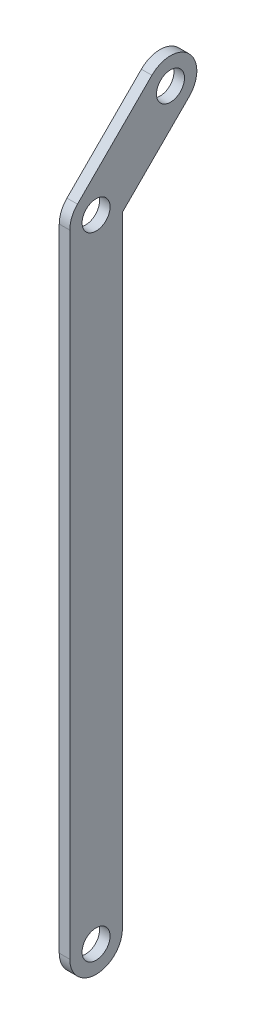
ISO-10303-21;
HEADER;
FILE_DESCRIPTION(('STEP AP214'),'2;1');
FILE_NAME('part.step','',(''),(''),'','','');
FILE_SCHEMA(('AUTOMOTIVE_DESIGN { 1 0 10303 214 1 1 1 1 }'));
ENDSEC;
DATA;
#1=APPLICATION_CONTEXT('core data for automotive mechanical design processes');
#2=APPLICATION_PROTOCOL_DEFINITION('international standard','automotive_design',2000,#1);
#3=PRODUCT_CONTEXT('',#1,'mechanical');
#4=PRODUCT('Part','Part','',(#3));
#5=PRODUCT_RELATED_PRODUCT_CATEGORY('part','',(#4));
#6=PRODUCT_DEFINITION_FORMATION('','',#4);
#7=PRODUCT_DEFINITION_CONTEXT('part definition',#1,'design');
#8=PRODUCT_DEFINITION('design','',#6,#7);
#9=PRODUCT_DEFINITION_SHAPE('','',#8);
#10=(LENGTH_UNIT() NAMED_UNIT(*) SI_UNIT(.MILLI.,.METRE.));
#11=(NAMED_UNIT(*) PLANE_ANGLE_UNIT() SI_UNIT($,.RADIAN.));
#12=(NAMED_UNIT(*) SI_UNIT($,.STERADIAN.) SOLID_ANGLE_UNIT());
#13=UNCERTAINTY_MEASURE_WITH_UNIT(LENGTH_MEASURE(1.E-05),#10,'distance_accuracy_value','');
#14=(GEOMETRIC_REPRESENTATION_CONTEXT(3) GLOBAL_UNCERTAINTY_ASSIGNED_CONTEXT((#13)) GLOBAL_UNIT_ASSIGNED_CONTEXT((#10,
#11,#12)) REPRESENTATION_CONTEXT('',''));
#15=CARTESIAN_POINT('',(0.,0.,0.));
#16=DIRECTION('',(0.,0.,1.));
#17=DIRECTION('',(1.,0.,0.));
#18=AXIS2_PLACEMENT_3D('',#15,#16,#17);
#19=CARTESIAN_POINT('',(2.54,-152.4,0.));
#20=DIRECTION('',(-1.,0.,0.));
#21=DIRECTION('',(0.,0.,1.));
#22=AXIS2_PLACEMENT_3D('',#19,#20,#21);
#23=CYLINDRICAL_SURFACE('',#22,6.35);
#24=CARTESIAN_POINT('',(0.,-152.4,0.));
#25=DIRECTION('',(1.,0.,0.));
#26=DIRECTION('',(0.,0.,-1.));
#27=AXIS2_PLACEMENT_3D('',#24,#25,#26);
#28=CIRCLE('',#27,6.35);
#29=CARTESIAN_POINT('',(0.,-152.4,6.34999999999998));
#30=VERTEX_POINT('',#29);
#31=CARTESIAN_POINT('',(0.,-152.4,-6.35000000000002));
#32=VERTEX_POINT('',#31);
#33=EDGE_CURVE('E124',#30,#32,#28,.T.);
#34=ORIENTED_EDGE('',*,*,#33,.T.);
#35=DIRECTION('',(-1.,0.,0.));
#36=VECTOR('',#35,1.);
#37=CARTESIAN_POINT('',(2.54,-152.4,-6.35000000000002));
#38=LINE('',#37,#36);
#39=CARTESIAN_POINT('',(2.54,-152.4,-6.35000000000002));
#40=VERTEX_POINT('',#39);
#41=EDGE_CURVE('E11',#40,#32,#38,.T.);
#42=ORIENTED_EDGE('',*,*,#41,.F.);
#43=CARTESIAN_POINT('',(2.54,-152.4,0.));
#44=DIRECTION('',(1.,0.,0.));
#45=DIRECTION('',(0.,0.,-1.));
#46=AXIS2_PLACEMENT_3D('',#43,#44,#45);
#47=CIRCLE('',#46,6.35);
#48=CARTESIAN_POINT('',(2.54,-152.4,6.34999999999998));
#49=VERTEX_POINT('',#48);
#50=EDGE_CURVE('E137',#49,#40,#47,.T.);
#51=ORIENTED_EDGE('',*,*,#50,.F.);
#52=DIRECTION('',(-1.,0.,0.));
#53=VECTOR('',#52,1.);
#54=CARTESIAN_POINT('',(2.54,-152.4,6.34999999999998));
#55=LINE('',#54,#53);
#56=EDGE_CURVE('E120',#49,#30,#55,.T.);
#57=ORIENTED_EDGE('',*,*,#56,.T.);
#58=EDGE_LOOP('',(#34,#42,#51,#57));
#59=FACE_BOUND('',#58,.T.);
#60=ADVANCED_FACE('F33',(#59),#23,.T.);
#61=CARTESIAN_POINT('',(2.54,-2.63025612106913,-6.35));
#62=DIRECTION('',(0.,0.,1.));
#63=DIRECTION('',(0.,-1.,0.));
#64=AXIS2_PLACEMENT_3D('',#61,#62,#63);
#65=PLANE('',#64);
#66=DIRECTION('',(0.,1.,0.));
#67=VECTOR('',#66,1.);
#68=CARTESIAN_POINT('',(0.,-2.63025612106913,-6.35));
#69=LINE('',#68,#67);
#70=CARTESIAN_POINT('',(0.,-2.63025612106913,-6.35));
#71=VERTEX_POINT('',#70);
#72=EDGE_CURVE('E127',#32,#71,#69,.T.);
#73=ORIENTED_EDGE('',*,*,#72,.T.);
#74=DIRECTION('',(-1.,0.,0.));
#75=VECTOR('',#74,1.);
#76=CARTESIAN_POINT('',(2.54,-2.63025612106913,-6.35));
#77=LINE('',#76,#75);
#78=CARTESIAN_POINT('',(2.54,-2.63025612106913,-6.35));
#79=VERTEX_POINT('',#78);
#80=EDGE_CURVE('E42',#79,#71,#77,.T.);
#81=ORIENTED_EDGE('',*,*,#80,.F.);
#82=DIRECTION('',(0.,1.,0.));
#83=VECTOR('',#82,1.);
#84=CARTESIAN_POINT('',(2.54,-2.63025612106913,-6.35));
#85=LINE('',#84,#83);
#86=EDGE_CURVE('E90',#40,#79,#85,.T.);
#87=ORIENTED_EDGE('',*,*,#86,.F.);
#88=ORIENTED_EDGE('',*,*,#41,.T.);
#89=EDGE_LOOP('',(#73,#81,#87,#88));
#90=FACE_BOUND('',#89,.T.);
#91=ADVANCED_FACE('F202',(#90),#65,.F.);
#92=CARTESIAN_POINT('',(2.54,-2.63025612106913,-6.35));
#93=DIRECTION('',(0.,0.707106781186543,0.707106781186552));
#94=DIRECTION('',(0.,-0.707106781186552,0.707106781186543));
#95=AXIS2_PLACEMENT_3D('',#92,#93,#94);
#96=PLANE('',#95);
#97=DIRECTION('',(0.,0.707106781186552,-0.707106781186543));
#98=VECTOR('',#97,1.);
#99=CARTESIAN_POINT('',(0.,-2.63025612106913,-6.35));
#100=LINE('',#99,#98);
#101=CARTESIAN_POINT('',(0.,13.4703841816039,-22.4506403026728));
#102=VERTEX_POINT('',#101);
#103=EDGE_CURVE('E130',#71,#102,#100,.T.);
#104=ORIENTED_EDGE('',*,*,#103,.T.);
#105=DIRECTION('',(-1.,0.,0.));
#106=VECTOR('',#105,1.);
#107=CARTESIAN_POINT('',(2.54,13.4703841816039,-22.4506403026728));
#108=LINE('',#107,#106);
#109=CARTESIAN_POINT('',(2.54,13.4703841816039,-22.4506403026728));
#110=VERTEX_POINT('',#109);
#111=EDGE_CURVE('E141',#110,#102,#108,.T.);
#112=ORIENTED_EDGE('',*,*,#111,.F.);
#113=DIRECTION('',(0.,0.707106781186552,-0.707106781186543));
#114=VECTOR('',#113,1.);
#115=CARTESIAN_POINT('',(2.54,-2.63025612106913,-6.35));
#116=LINE('',#115,#114);
#117=EDGE_CURVE('E150',#79,#110,#116,.T.);
#118=ORIENTED_EDGE('',*,*,#117,.F.);
#119=ORIENTED_EDGE('',*,*,#80,.T.);
#120=EDGE_LOOP('',(#104,#112,#118,#119));
#121=FACE_BOUND('',#120,.T.);
#122=ADVANCED_FACE('F148',(#121),#96,.F.);
#123=CARTESIAN_POINT('',(2.54,17.9605122421384,-17.9605122421382));
#124=DIRECTION('',(-1.,0.,0.));
#125=DIRECTION('',(0.,0.,1.));
#126=AXIS2_PLACEMENT_3D('',#123,#124,#125);
#127=CYLINDRICAL_SURFACE('',#126,6.35);
#128=CARTESIAN_POINT('',(0.,17.9605122421384,-17.9605122421382));
#129=DIRECTION('',(1.,0.,0.));
#130=DIRECTION('',(0.,0.,-1.));
#131=AXIS2_PLACEMENT_3D('',#128,#129,#130);
#132=CIRCLE('',#131,6.35);
#133=CARTESIAN_POINT('',(0.,22.450640302673,-13.4703841816036));
#134=VERTEX_POINT('',#133);
#135=EDGE_CURVE('E132',#102,#134,#132,.T.);
#136=ORIENTED_EDGE('',*,*,#135,.T.);
#137=DIRECTION('',(-1.,0.,0.));
#138=VECTOR('',#137,1.);
#139=CARTESIAN_POINT('',(2.54,22.450640302673,-13.4703841816036));
#140=LINE('',#139,#138);
#141=CARTESIAN_POINT('',(2.54,22.450640302673,-13.4703841816036));
#142=VERTEX_POINT('',#141);
#143=EDGE_CURVE('E115',#142,#134,#140,.T.);
#144=ORIENTED_EDGE('',*,*,#143,.F.);
#145=CARTESIAN_POINT('',(2.54,17.9605122421384,-17.9605122421382));
#146=DIRECTION('',(1.,0.,0.));
#147=DIRECTION('',(0.,0.,-1.));
#148=AXIS2_PLACEMENT_3D('',#145,#146,#147);
#149=CIRCLE('',#148,6.35);
#150=EDGE_CURVE('E106',#110,#142,#149,.T.);
#151=ORIENTED_EDGE('',*,*,#150,.F.);
#152=ORIENTED_EDGE('',*,*,#111,.T.);
#153=EDGE_LOOP('',(#136,#144,#151,#152));
#154=FACE_BOUND('',#153,.T.);
#155=ADVANCED_FACE('F156',(#154),#127,.T.);
#156=CARTESIAN_POINT('',(2.54,4.49012806053455,4.4901280605346));
#157=DIRECTION('',(0.,-0.707106781186544,-0.707106781186551));
#158=DIRECTION('',(0.,0.707106781186551,-0.707106781186544));
#159=AXIS2_PLACEMENT_3D('',#156,#157,#158);
#160=PLANE('',#159);
#161=DIRECTION('',(0.,-0.707106781186551,0.707106781186544));
#162=VECTOR('',#161,1.);
#163=CARTESIAN_POINT('',(0.,4.49012806053455,4.4901280605346));
#164=LINE('',#163,#162);
#165=CARTESIAN_POINT('',(0.,4.49012806053455,4.4901280605346));
#166=VERTEX_POINT('',#165);
#167=EDGE_CURVE('E114',#134,#166,#164,.T.);
#168=ORIENTED_EDGE('',*,*,#167,.T.);
#169=DIRECTION('',(-1.,0.,0.));
#170=VECTOR('',#169,1.);
#171=CARTESIAN_POINT('',(2.54,4.49012806053455,4.4901280605346));
#172=LINE('',#171,#170);
#173=CARTESIAN_POINT('',(2.54,4.49012806053455,4.4901280605346));
#174=VERTEX_POINT('',#173);
#175=EDGE_CURVE('E111',#174,#166,#172,.T.);
#176=ORIENTED_EDGE('',*,*,#175,.F.);
#177=DIRECTION('',(0.,-0.707106781186551,0.707106781186544));
#178=VECTOR('',#177,1.);
#179=CARTESIAN_POINT('',(2.54,4.49012806053455,4.4901280605346));
#180=LINE('',#179,#178);
#181=EDGE_CURVE('E100',#142,#174,#180,.T.);
#182=ORIENTED_EDGE('',*,*,#181,.F.);
#183=ORIENTED_EDGE('',*,*,#143,.T.);
#184=EDGE_LOOP('',(#168,#176,#182,#183));
#185=FACE_BOUND('',#184,.T.);
#186=ADVANCED_FACE('F112',(#185),#160,.F.);
#187=CARTESIAN_POINT('',(2.54,0.,0.));
#188=DIRECTION('',(-1.,0.,0.));
#189=DIRECTION('',(0.,0.,1.));
#190=AXIS2_PLACEMENT_3D('',#187,#188,#189);
#191=CYLINDRICAL_SURFACE('',#190,6.35);
#192=CARTESIAN_POINT('',(0.,0.,0.));
#193=DIRECTION('',(1.,0.,0.));
#194=DIRECTION('',(0.,0.,-1.));
#195=AXIS2_PLACEMENT_3D('',#192,#193,#194);
#196=CIRCLE('',#195,6.35);
#197=CARTESIAN_POINT('',(0.,0.,6.35));
#198=VERTEX_POINT('',#197);
#199=EDGE_CURVE('E76',#166,#198,#196,.T.);
#200=ORIENTED_EDGE('',*,*,#199,.T.);
#201=DIRECTION('',(-1.,0.,0.));
#202=VECTOR('',#201,1.);
#203=CARTESIAN_POINT('',(2.54,0.,6.35));
#204=LINE('',#203,#202);
#205=CARTESIAN_POINT('',(2.54,0.,6.35));
#206=VERTEX_POINT('',#205);
#207=EDGE_CURVE('E116',#206,#198,#204,.T.);
#208=ORIENTED_EDGE('',*,*,#207,.F.);
#209=CARTESIAN_POINT('',(2.54,0.,0.));
#210=DIRECTION('',(1.,0.,0.));
#211=DIRECTION('',(0.,0.,-1.));
#212=AXIS2_PLACEMENT_3D('',#209,#210,#211);
#213=CIRCLE('',#212,6.35);
#214=EDGE_CURVE('E104',#174,#206,#213,.T.);
#215=ORIENTED_EDGE('',*,*,#214,.F.);
#216=ORIENTED_EDGE('',*,*,#175,.T.);
#217=EDGE_LOOP('',(#200,#208,#215,#216));
#218=FACE_BOUND('',#217,.T.);
#219=ADVANCED_FACE('F118',(#218),#191,.T.);
#220=CARTESIAN_POINT('',(2.54,0.,6.35));
#221=DIRECTION('',(0.,0.,-1.));
#222=DIRECTION('',(0.,1.,0.));
#223=AXIS2_PLACEMENT_3D('',#220,#221,#222);
#224=PLANE('',#223);
#225=DIRECTION('',(0.,-1.,0.));
#226=VECTOR('',#225,1.);
#227=CARTESIAN_POINT('',(0.,0.,6.35));
#228=LINE('',#227,#226);
#229=EDGE_CURVE('E82',#198,#30,#228,.T.);
#230=ORIENTED_EDGE('',*,*,#229,.T.);
#231=ORIENTED_EDGE('',*,*,#56,.F.);
#232=DIRECTION('',(0.,-1.,0.));
#233=VECTOR('',#232,1.);
#234=CARTESIAN_POINT('',(2.54,0.,6.35));
#235=LINE('',#234,#233);
#236=EDGE_CURVE('E50',#206,#49,#235,.T.);
#237=ORIENTED_EDGE('',*,*,#236,.F.);
#238=ORIENTED_EDGE('',*,*,#207,.T.);
#239=EDGE_LOOP('',(#230,#231,#237,#238));
#240=FACE_BOUND('',#239,.T.);
#241=ADVANCED_FACE('F181',(#240),#224,.F.);
#242=CARTESIAN_POINT('',(2.54,-152.4,0.));
#243=DIRECTION('',(1.,0.,0.));
#244=DIRECTION('',(0.,0.,-1.));
#245=AXIS2_PLACEMENT_3D('',#242,#243,#244);
#246=PLANE('',#245);
#247=CARTESIAN_POINT('',(2.54,0.,0.));
#248=DIRECTION('',(1.,0.,0.));
#249=DIRECTION('',(0.,0.,-1.));
#250=AXIS2_PLACEMENT_3D('',#247,#248,#249);
#251=CIRCLE('',#250,3.37819999999999);
#252=CARTESIAN_POINT('',(2.54,0.,-3.37819999999999));
#253=VERTEX_POINT('',#252);
#254=EDGE_CURVE('E172',#253,#253,#251,.T.);
#255=ORIENTED_EDGE('',*,*,#254,.F.);
#256=EDGE_LOOP('',(#255));
#257=FACE_BOUND('',#256,.T.);
#258=CARTESIAN_POINT('',(2.54,-152.4,0.));
#259=DIRECTION('',(1.,0.,0.));
#260=DIRECTION('',(0.,0.,-1.));
#261=AXIS2_PLACEMENT_3D('',#258,#259,#260);
#262=CIRCLE('',#261,3.3782);
#263=CARTESIAN_POINT('',(2.54,-152.4,-3.37820000000002));
#264=VERTEX_POINT('',#263);
#265=EDGE_CURVE('E166',#264,#264,#262,.T.);
#266=ORIENTED_EDGE('',*,*,#265,.F.);
#267=EDGE_LOOP('',(#266));
#268=FACE_BOUND('',#267,.T.);
#269=CARTESIAN_POINT('',(2.54,17.9605122421384,-17.9605122421382));
#270=DIRECTION('',(1.,0.,0.));
#271=DIRECTION('',(0.,0.,-1.));
#272=AXIS2_PLACEMENT_3D('',#269,#270,#271);
#273=CIRCLE('',#272,3.37819999999999);
#274=CARTESIAN_POINT('',(2.54,17.9605122421384,-21.3387122421382));
#275=VERTEX_POINT('',#274);
#276=EDGE_CURVE('E163',#275,#275,#273,.T.);
#277=ORIENTED_EDGE('',*,*,#276,.F.);
#278=EDGE_LOOP('',(#277));
#279=FACE_BOUND('',#278,.T.);
#280=ORIENTED_EDGE('',*,*,#50,.T.);
#281=ORIENTED_EDGE('',*,*,#86,.T.);
#282=ORIENTED_EDGE('',*,*,#117,.T.);
#283=ORIENTED_EDGE('',*,*,#150,.T.);
#284=ORIENTED_EDGE('',*,*,#181,.T.);
#285=ORIENTED_EDGE('',*,*,#214,.T.);
#286=ORIENTED_EDGE('',*,*,#236,.T.);
#287=EDGE_LOOP('',(#280,#281,#282,#283,#284,#285,#286));
#288=FACE_BOUND('',#287,.T.);
#289=ADVANCED_FACE('F102',(#257,#268,#279,#288),#246,.T.);
#290=CARTESIAN_POINT('',(0.,-152.4,0.));
#291=DIRECTION('',(1.,0.,0.));
#292=DIRECTION('',(0.,0.,-1.));
#293=AXIS2_PLACEMENT_3D('',#290,#291,#292);
#294=PLANE('',#293);
#295=CARTESIAN_POINT('',(0.,0.,0.));
#296=DIRECTION('',(1.,0.,0.));
#297=DIRECTION('',(0.,0.,-1.));
#298=AXIS2_PLACEMENT_3D('',#295,#296,#297);
#299=CIRCLE('',#298,3.37819999999999);
#300=CARTESIAN_POINT('',(0.,0.,-3.37819999999999));
#301=VERTEX_POINT('',#300);
#302=EDGE_CURVE('E169',#301,#301,#299,.T.);
#303=ORIENTED_EDGE('',*,*,#302,.T.);
#304=EDGE_LOOP('',(#303));
#305=FACE_BOUND('',#304,.T.);
#306=CARTESIAN_POINT('',(0.,-152.4,0.));
#307=DIRECTION('',(1.,0.,0.));
#308=DIRECTION('',(0.,0.,-1.));
#309=AXIS2_PLACEMENT_3D('',#306,#307,#308);
#310=CIRCLE('',#309,3.3782);
#311=CARTESIAN_POINT('',(0.,-152.4,-3.37820000000002));
#312=VERTEX_POINT('',#311);
#313=EDGE_CURVE('E36',#312,#312,#310,.T.);
#314=ORIENTED_EDGE('',*,*,#313,.T.);
#315=EDGE_LOOP('',(#314));
#316=FACE_BOUND('',#315,.T.);
#317=CARTESIAN_POINT('',(0.,17.9605122421384,-17.9605122421382));
#318=DIRECTION('',(1.,0.,0.));
#319=DIRECTION('',(0.,0.,-1.));
#320=AXIS2_PLACEMENT_3D('',#317,#318,#319);
#321=CIRCLE('',#320,3.37819999999999);
#322=CARTESIAN_POINT('',(0.,17.9605122421384,-21.3387122421382));
#323=VERTEX_POINT('',#322);
#324=EDGE_CURVE('E128',#323,#323,#321,.T.);
#325=ORIENTED_EDGE('',*,*,#324,.T.);
#326=EDGE_LOOP('',(#325));
#327=FACE_BOUND('',#326,.T.);
#328=ORIENTED_EDGE('',*,*,#33,.F.);
#329=ORIENTED_EDGE('',*,*,#229,.F.);
#330=ORIENTED_EDGE('',*,*,#199,.F.);
#331=ORIENTED_EDGE('',*,*,#167,.F.);
#332=ORIENTED_EDGE('',*,*,#135,.F.);
#333=ORIENTED_EDGE('',*,*,#103,.F.);
#334=ORIENTED_EDGE('',*,*,#72,.F.);
#335=EDGE_LOOP('',(#328,#329,#330,#331,#332,#333,#334));
#336=FACE_BOUND('',#335,.T.);
#337=ADVANCED_FACE('F154',(#305,#316,#327,#336),#294,.F.);
#338=CARTESIAN_POINT('',(2.54,17.9605122421384,-17.9605122421382));
#339=DIRECTION('',(1.,0.,0.));
#340=DIRECTION('',(0.,0.,-1.));
#341=AXIS2_PLACEMENT_3D('',#338,#339,#340);
#342=CYLINDRICAL_SURFACE('',#341,3.37819999999999);
#343=ORIENTED_EDGE('',*,*,#276,.T.);
#344=EDGE_LOOP('',(#343));
#345=FACE_BOUND('',#344,.T.);
#346=ORIENTED_EDGE('',*,*,#324,.F.);
#347=EDGE_LOOP('',(#346));
#348=FACE_BOUND('',#347,.T.);
#349=ADVANCED_FACE('F187',(#345,#348),#342,.F.);
#350=CARTESIAN_POINT('',(2.54,-152.4,0.));
#351=DIRECTION('',(1.,0.,0.));
#352=DIRECTION('',(0.,0.,-1.));
#353=AXIS2_PLACEMENT_3D('',#350,#351,#352);
#354=CYLINDRICAL_SURFACE('',#353,3.3782);
#355=ORIENTED_EDGE('',*,*,#265,.T.);
#356=EDGE_LOOP('',(#355));
#357=FACE_BOUND('',#356,.T.);
#358=ORIENTED_EDGE('',*,*,#313,.F.);
#359=EDGE_LOOP('',(#358));
#360=FACE_BOUND('',#359,.T.);
#361=ADVANCED_FACE('F190',(#357,#360),#354,.F.);
#362=CARTESIAN_POINT('',(2.54,0.,0.));
#363=DIRECTION('',(1.,0.,0.));
#364=DIRECTION('',(0.,0.,-1.));
#365=AXIS2_PLACEMENT_3D('',#362,#363,#364);
#366=CYLINDRICAL_SURFACE('',#365,3.37819999999999);
#367=ORIENTED_EDGE('',*,*,#254,.T.);
#368=EDGE_LOOP('',(#367));
#369=FACE_BOUND('',#368,.T.);
#370=ORIENTED_EDGE('',*,*,#302,.F.);
#371=EDGE_LOOP('',(#370));
#372=FACE_BOUND('',#371,.T.);
#373=ADVANCED_FACE('F176',(#369,#372),#366,.F.);
#374=CLOSED_SHELL('',(#60,#91,#122,#155,#186,#219,#241,#289,#337,#349,#361,#373));
#375=MANIFOLD_SOLID_BREP('B2',#374);
#376=ADVANCED_BREP_SHAPE_REPRESENTATION('',(#18,#375),#14);
#377=SHAPE_DEFINITION_REPRESENTATION(#9,#376);
ENDSEC;
END-ISO-10303-21;
